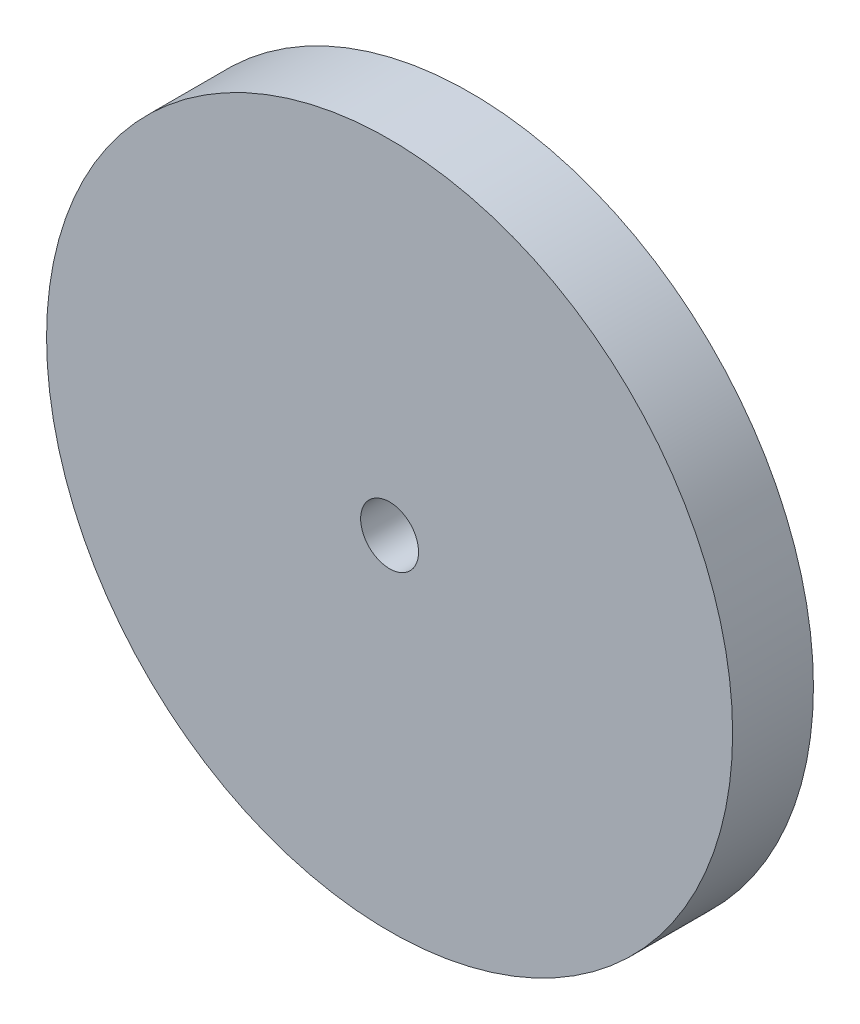
ISO-10303-21;
HEADER;
FILE_DESCRIPTION(('STEP AP214'),'2;1');
FILE_NAME('part.step','',(''),(''),'','','');
FILE_SCHEMA(('AUTOMOTIVE_DESIGN { 1 0 10303 214 1 1 1 1 }'));
ENDSEC;
DATA;
#1=APPLICATION_CONTEXT('core data for automotive mechanical design processes');
#2=APPLICATION_PROTOCOL_DEFINITION('international standard','automotive_design',2000,#1);
#3=PRODUCT_CONTEXT('',#1,'mechanical');
#4=PRODUCT('Part','Part','',(#3));
#5=PRODUCT_RELATED_PRODUCT_CATEGORY('part','',(#4));
#6=PRODUCT_DEFINITION_FORMATION('','',#4);
#7=PRODUCT_DEFINITION_CONTEXT('part definition',#1,'design');
#8=PRODUCT_DEFINITION('design','',#6,#7);
#9=PRODUCT_DEFINITION_SHAPE('','',#8);
#10=(LENGTH_UNIT() NAMED_UNIT(*) SI_UNIT(.MILLI.,.METRE.));
#11=(NAMED_UNIT(*) PLANE_ANGLE_UNIT() SI_UNIT($,.RADIAN.));
#12=(NAMED_UNIT(*) SI_UNIT($,.STERADIAN.) SOLID_ANGLE_UNIT());
#13=UNCERTAINTY_MEASURE_WITH_UNIT(LENGTH_MEASURE(1.E-05),#10,'distance_accuracy_value','');
#14=(GEOMETRIC_REPRESENTATION_CONTEXT(3) GLOBAL_UNCERTAINTY_ASSIGNED_CONTEXT((#13)) GLOBAL_UNIT_ASSIGNED_CONTEXT((#10,
#11,#12)) REPRESENTATION_CONTEXT('',''));
#15=CARTESIAN_POINT('',(0.,0.,0.));
#16=DIRECTION('',(0.,0.,1.));
#17=DIRECTION('',(1.,0.,0.));
#18=AXIS2_PLACEMENT_3D('',#15,#16,#17);
#19=CARTESIAN_POINT('',(0.,0.,3.81));
#20=DIRECTION('',(0.,0.,-1.));
#21=DIRECTION('',(-1.,0.,0.));
#22=AXIS2_PLACEMENT_3D('',#19,#20,#21);
#23=CYLINDRICAL_SURFACE('',#22,32.3469);
#24=CARTESIAN_POINT('',(0.,0.,3.81));
#25=DIRECTION('',(0.,0.,1.));
#26=DIRECTION('',(1.,0.,0.));
#27=AXIS2_PLACEMENT_3D('',#24,#25,#26);
#28=CIRCLE('',#27,32.3469);
#29=CARTESIAN_POINT('',(32.3469,0.,3.81));
#30=VERTEX_POINT('',#29);
#31=EDGE_CURVE('E10',#30,#30,#28,.T.);
#32=ORIENTED_EDGE('',*,*,#31,.F.);
#33=EDGE_LOOP('',(#32));
#34=FACE_BOUND('',#33,.T.);
#35=CARTESIAN_POINT('',(0.,0.,-3.81));
#36=DIRECTION('',(0.,0.,1.));
#37=DIRECTION('',(1.,0.,0.));
#38=AXIS2_PLACEMENT_3D('',#35,#36,#37);
#39=CIRCLE('',#38,32.3469);
#40=CARTESIAN_POINT('',(32.3469,0.,-3.81));
#41=VERTEX_POINT('',#40);
#42=EDGE_CURVE('E33',#41,#41,#39,.T.);
#43=ORIENTED_EDGE('',*,*,#42,.T.);
#44=EDGE_LOOP('',(#43));
#45=FACE_BOUND('',#44,.T.);
#46=ADVANCED_FACE('F30',(#34,#45),#23,.T.);
#47=CARTESIAN_POINT('',(0.,0.,3.81));
#48=DIRECTION('',(0.,0.,1.));
#49=DIRECTION('',(1.,0.,0.));
#50=AXIS2_PLACEMENT_3D('',#47,#48,#49);
#51=PLANE('',#50);
#52=CARTESIAN_POINT('',(0.,0.,3.81));
#53=DIRECTION('',(0.,0.,1.));
#54=DIRECTION('',(1.,0.,0.));
#55=AXIS2_PLACEMENT_3D('',#52,#53,#54);
#56=CIRCLE('',#55,2.7305);
#57=CARTESIAN_POINT('',(2.7305,0.,3.81));
#58=VERTEX_POINT('',#57);
#59=EDGE_CURVE('E44',#58,#58,#56,.T.);
#60=ORIENTED_EDGE('',*,*,#59,.F.);
#61=EDGE_LOOP('',(#60));
#62=FACE_BOUND('',#61,.T.);
#63=ORIENTED_EDGE('',*,*,#31,.T.);
#64=EDGE_LOOP('',(#63));
#65=FACE_BOUND('',#64,.T.);
#66=ADVANCED_FACE('F50',(#62,#65),#51,.T.);
#67=CARTESIAN_POINT('',(0.,0.,-3.81));
#68=DIRECTION('',(0.,0.,1.));
#69=DIRECTION('',(1.,0.,0.));
#70=AXIS2_PLACEMENT_3D('',#67,#68,#69);
#71=PLANE('',#70);
#72=CARTESIAN_POINT('',(0.,0.,-3.81));
#73=DIRECTION('',(0.,0.,1.));
#74=DIRECTION('',(1.,0.,0.));
#75=AXIS2_PLACEMENT_3D('',#72,#73,#74);
#76=CIRCLE('',#75,2.7305);
#77=CARTESIAN_POINT('',(2.7305,0.,-3.81));
#78=VERTEX_POINT('',#77);
#79=EDGE_CURVE('E40',#78,#78,#76,.F.);
#80=ORIENTED_EDGE('',*,*,#79,.F.);
#81=EDGE_LOOP('',(#80));
#82=FACE_BOUND('',#81,.T.);
#83=ORIENTED_EDGE('',*,*,#42,.F.);
#84=EDGE_LOOP('',(#83));
#85=FACE_BOUND('',#84,.T.);
#86=ADVANCED_FACE('F52',(#82,#85),#71,.F.);
#87=CARTESIAN_POINT('',(0.,0.,-11.5330202641195));
#88=DIRECTION('',(0.,0.,1.));
#89=DIRECTION('',(1.,0.,0.));
#90=AXIS2_PLACEMENT_3D('',#87,#88,#89);
#91=CYLINDRICAL_SURFACE('',#90,2.7305);
#92=ORIENTED_EDGE('',*,*,#79,.T.);
#93=EDGE_LOOP('',(#92));
#94=FACE_BOUND('',#93,.T.);
#95=ORIENTED_EDGE('',*,*,#59,.T.);
#96=EDGE_LOOP('',(#95));
#97=FACE_BOUND('',#96,.T.);
#98=ADVANCED_FACE('F48',(#94,#97),#91,.F.);
#99=CLOSED_SHELL('',(#46,#66,#86,#98));
#100=MANIFOLD_SOLID_BREP('B2',#99);
#101=ADVANCED_BREP_SHAPE_REPRESENTATION('',(#18,#100),#14);
#102=SHAPE_DEFINITION_REPRESENTATION(#9,#101);
ENDSEC;
END-ISO-10303-21;
